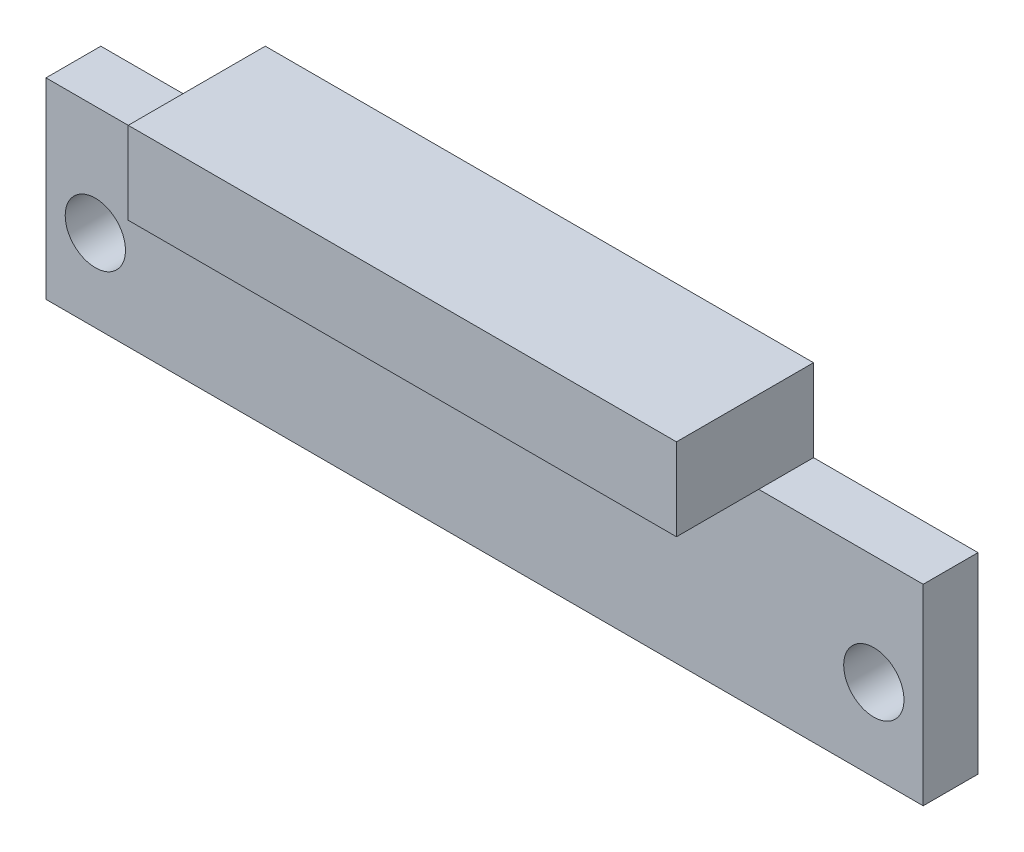
ISO-10303-21;
HEADER;
FILE_DESCRIPTION(('STEP AP214'),'2;1');
FILE_NAME('part.step','',(''),(''),'','','');
FILE_SCHEMA(('AUTOMOTIVE_DESIGN { 1 0 10303 214 1 1 1 1 }'));
ENDSEC;
DATA;
#1=APPLICATION_CONTEXT('core data for automotive mechanical design processes');
#2=APPLICATION_PROTOCOL_DEFINITION('international standard','automotive_design',2000,#1);
#3=PRODUCT_CONTEXT('',#1,'mechanical');
#4=PRODUCT('Part','Part','',(#3));
#5=PRODUCT_RELATED_PRODUCT_CATEGORY('part','',(#4));
#6=PRODUCT_DEFINITION_FORMATION('','',#4);
#7=PRODUCT_DEFINITION_CONTEXT('part definition',#1,'design');
#8=PRODUCT_DEFINITION('design','',#6,#7);
#9=PRODUCT_DEFINITION_SHAPE('','',#8);
#10=(LENGTH_UNIT() NAMED_UNIT(*) SI_UNIT(.MILLI.,.METRE.));
#11=(NAMED_UNIT(*) PLANE_ANGLE_UNIT() SI_UNIT($,.RADIAN.));
#12=(NAMED_UNIT(*) SI_UNIT($,.STERADIAN.) SOLID_ANGLE_UNIT());
#13=UNCERTAINTY_MEASURE_WITH_UNIT(LENGTH_MEASURE(1.E-05),#10,'distance_accuracy_value','');
#14=(GEOMETRIC_REPRESENTATION_CONTEXT(3) GLOBAL_UNCERTAINTY_ASSIGNED_CONTEXT((#13)) GLOBAL_UNIT_ASSIGNED_CONTEXT((#10,
#11,#12)) REPRESENTATION_CONTEXT('',''));
#15=CARTESIAN_POINT('',(0.,0.,0.));
#16=DIRECTION('',(0.,0.,1.));
#17=DIRECTION('',(1.,0.,0.));
#18=AXIS2_PLACEMENT_3D('',#15,#16,#17);
#19=CARTESIAN_POINT('',(0.,7.,2.));
#20=DIRECTION('',(0.,-1.,0.));
#21=DIRECTION('',(0.,0.,-1.));
#22=AXIS2_PLACEMENT_3D('',#19,#20,#21);
#23=PLANE('',#22);
#24=DIRECTION('',(0.,0.,-1.));
#25=VECTOR('',#24,1.);
#26=CARTESIAN_POINT('',(26.,7.,5.));
#27=LINE('',#26,#25);
#28=CARTESIAN_POINT('',(26.,7.,2.));
#29=VERTEX_POINT('',#28);
#30=CARTESIAN_POINT('',(26.,7.,0.));
#31=VERTEX_POINT('',#30);
#32=EDGE_CURVE('E11',#29,#31,#27,.T.);
#33=ORIENTED_EDGE('',*,*,#32,.F.);
#34=DIRECTION('',(-1.,0.,0.));
#35=VECTOR('',#34,1.);
#36=CARTESIAN_POINT('',(0.,7.,2.));
#37=LINE('',#36,#35);
#38=CARTESIAN_POINT('',(32.,7.,2.));
#39=VERTEX_POINT('',#38);
#40=EDGE_CURVE('E173',#39,#29,#37,.T.);
#41=ORIENTED_EDGE('',*,*,#40,.F.);
#42=DIRECTION('',(0.,0.,-1.));
#43=VECTOR('',#42,1.);
#44=CARTESIAN_POINT('',(32.,7.,2.));
#45=LINE('',#44,#43);
#46=CARTESIAN_POINT('',(32.,7.,0.));
#47=VERTEX_POINT('',#46);
#48=EDGE_CURVE('E186',#39,#47,#45,.T.);
#49=ORIENTED_EDGE('',*,*,#48,.T.);
#50=DIRECTION('',(-1.,0.,0.));
#51=VECTOR('',#50,1.);
#52=CARTESIAN_POINT('',(0.,7.,0.));
#53=LINE('',#52,#51);
#54=EDGE_CURVE('E169',#47,#31,#53,.T.);
#55=ORIENTED_EDGE('',*,*,#54,.T.);
#56=EDGE_LOOP('',(#33,#41,#49,#55));
#57=FACE_BOUND('',#56,.T.);
#58=ADVANCED_FACE('F33',(#57),#23,.F.);
#59=CARTESIAN_POINT('',(0.,0.,2.));
#60=DIRECTION('',(1.,0.,0.));
#61=DIRECTION('',(0.,0.,-1.));
#62=AXIS2_PLACEMENT_3D('',#59,#60,#61);
#63=PLANE('',#62);
#64=DIRECTION('',(0.,-1.,0.));
#65=VECTOR('',#64,1.);
#66=CARTESIAN_POINT('',(0.,0.,0.));
#67=LINE('',#66,#65);
#68=CARTESIAN_POINT('',(0.,7.,0.));
#69=VERTEX_POINT('',#68);
#70=CARTESIAN_POINT('',(0.,0.,0.));
#71=VERTEX_POINT('',#70);
#72=EDGE_CURVE('E158',#69,#71,#67,.T.);
#73=ORIENTED_EDGE('',*,*,#72,.T.);
#74=DIRECTION('',(0.,0.,-1.));
#75=VECTOR('',#74,1.);
#76=CARTESIAN_POINT('',(0.,0.,2.));
#77=LINE('',#76,#75);
#78=CARTESIAN_POINT('',(0.,0.,2.));
#79=VERTEX_POINT('',#78);
#80=EDGE_CURVE('E37',#79,#71,#77,.T.);
#81=ORIENTED_EDGE('',*,*,#80,.F.);
#82=DIRECTION('',(0.,-1.,0.));
#83=VECTOR('',#82,1.);
#84=CARTESIAN_POINT('',(0.,0.,2.));
#85=LINE('',#84,#83);
#86=CARTESIAN_POINT('',(0.,7.,2.));
#87=VERTEX_POINT('',#86);
#88=EDGE_CURVE('E167',#87,#79,#85,.T.);
#89=ORIENTED_EDGE('',*,*,#88,.F.);
#90=DIRECTION('',(0.,0.,-1.));
#91=VECTOR('',#90,1.);
#92=CARTESIAN_POINT('',(0.,7.,2.));
#93=LINE('',#92,#91);
#94=EDGE_CURVE('E176',#87,#69,#93,.T.);
#95=ORIENTED_EDGE('',*,*,#94,.T.);
#96=EDGE_LOOP('',(#73,#81,#89,#95));
#97=FACE_BOUND('',#96,.T.);
#98=ADVANCED_FACE('F35',(#97),#63,.F.);
#99=CARTESIAN_POINT('',(0.,0.,2.));
#100=DIRECTION('',(0.,1.,0.));
#101=DIRECTION('',(0.,0.,1.));
#102=AXIS2_PLACEMENT_3D('',#99,#100,#101);
#103=PLANE('',#102);
#104=DIRECTION('',(1.,0.,0.));
#105=VECTOR('',#104,1.);
#106=CARTESIAN_POINT('',(0.,0.,0.));
#107=LINE('',#106,#105);
#108=CARTESIAN_POINT('',(32.,0.,0.));
#109=VERTEX_POINT('',#108);
#110=EDGE_CURVE('E179',#71,#109,#107,.T.);
#111=ORIENTED_EDGE('',*,*,#110,.T.);
#112=DIRECTION('',(0.,0.,-1.));
#113=VECTOR('',#112,1.);
#114=CARTESIAN_POINT('',(32.,0.,2.));
#115=LINE('',#114,#113);
#116=CARTESIAN_POINT('',(32.,0.,2.));
#117=VERTEX_POINT('',#116);
#118=EDGE_CURVE('E188',#117,#109,#115,.T.);
#119=ORIENTED_EDGE('',*,*,#118,.F.);
#120=DIRECTION('',(1.,0.,0.));
#121=VECTOR('',#120,1.);
#122=CARTESIAN_POINT('',(0.,0.,2.));
#123=LINE('',#122,#121);
#124=EDGE_CURVE('E89',#79,#117,#123,.T.);
#125=ORIENTED_EDGE('',*,*,#124,.F.);
#126=ORIENTED_EDGE('',*,*,#80,.T.);
#127=EDGE_LOOP('',(#111,#119,#125,#126));
#128=FACE_BOUND('',#127,.T.);
#129=ADVANCED_FACE('F203',(#128),#103,.F.);
#130=CARTESIAN_POINT('',(32.,0.,2.));
#131=DIRECTION('',(-1.,0.,0.));
#132=DIRECTION('',(0.,0.,1.));
#133=AXIS2_PLACEMENT_3D('',#130,#131,#132);
#134=PLANE('',#133);
#135=DIRECTION('',(0.,1.,0.));
#136=VECTOR('',#135,1.);
#137=CARTESIAN_POINT('',(32.,0.,0.));
#138=LINE('',#137,#136);
#139=EDGE_CURVE('E181',#109,#47,#138,.T.);
#140=ORIENTED_EDGE('',*,*,#139,.T.);
#141=ORIENTED_EDGE('',*,*,#48,.F.);
#142=DIRECTION('',(0.,1.,0.));
#143=VECTOR('',#142,1.);
#144=CARTESIAN_POINT('',(32.,0.,2.));
#145=LINE('',#144,#143);
#146=EDGE_CURVE('E171',#117,#39,#145,.T.);
#147=ORIENTED_EDGE('',*,*,#146,.F.);
#148=ORIENTED_EDGE('',*,*,#118,.T.);
#149=EDGE_LOOP('',(#140,#141,#147,#148));
#150=FACE_BOUND('',#149,.T.);
#151=ADVANCED_FACE('F204',(#150),#134,.F.);
#152=CARTESIAN_POINT('',(6.,7.,2.));
#153=VERTEX_POINT('',#152);
#154=EDGE_CURVE('E60',#153,#87,#37,.T.);
#155=ORIENTED_EDGE('',*,*,#154,.F.);
#156=DIRECTION('',(0.,0.,-1.));
#157=VECTOR('',#156,1.);
#158=CARTESIAN_POINT('',(6.,7.,5.));
#159=LINE('',#158,#157);
#160=CARTESIAN_POINT('',(6.,7.,0.));
#161=VERTEX_POINT('',#160);
#162=EDGE_CURVE('E42',#153,#161,#159,.T.);
#163=ORIENTED_EDGE('',*,*,#162,.T.);
#164=EDGE_CURVE('E81',#161,#69,#53,.T.);
#165=ORIENTED_EDGE('',*,*,#164,.T.);
#166=ORIENTED_EDGE('',*,*,#94,.F.);
#167=EDGE_LOOP('',(#155,#163,#165,#166));
#168=FACE_BOUND('',#167,.T.);
#169=ADVANCED_FACE('F194',(#168),#23,.F.);
#170=CARTESIAN_POINT('',(0.,0.,2.));
#171=DIRECTION('',(0.,0.,-1.));
#172=DIRECTION('',(-1.,0.,0.));
#173=AXIS2_PLACEMENT_3D('',#170,#171,#172);
#174=PLANE('',#173);
#175=CARTESIAN_POINT('',(30.2,3.,2.));
#176=DIRECTION('',(0.,0.,-1.));
#177=DIRECTION('',(-1.,0.,0.));
#178=AXIS2_PLACEMENT_3D('',#175,#176,#177);
#179=CIRCLE('',#178,1.1);
#180=CARTESIAN_POINT('',(29.1,3.,2.));
#181=VERTEX_POINT('',#180);
#182=EDGE_CURVE('E155',#181,#181,#179,.T.);
#183=ORIENTED_EDGE('',*,*,#182,.T.);
#184=EDGE_LOOP('',(#183));
#185=FACE_BOUND('',#184,.T.);
#186=CARTESIAN_POINT('',(1.8,3.,2.));
#187=DIRECTION('',(0.,0.,-1.));
#188=DIRECTION('',(-1.,0.,0.));
#189=AXIS2_PLACEMENT_3D('',#186,#187,#188);
#190=CIRCLE('',#189,1.1);
#191=CARTESIAN_POINT('',(0.700000000000003,3.,2.));
#192=VERTEX_POINT('',#191);
#193=EDGE_CURVE('E162',#192,#192,#190,.T.);
#194=ORIENTED_EDGE('',*,*,#193,.T.);
#195=EDGE_LOOP('',(#194));
#196=FACE_BOUND('',#195,.T.);
#197=ORIENTED_EDGE('',*,*,#88,.T.);
#198=ORIENTED_EDGE('',*,*,#124,.T.);
#199=ORIENTED_EDGE('',*,*,#146,.T.);
#200=ORIENTED_EDGE('',*,*,#40,.T.);
#201=EDGE_CURVE('E120',#29,#153,#37,.T.);
#202=ORIENTED_EDGE('',*,*,#201,.T.);
#203=ORIENTED_EDGE('',*,*,#154,.T.);
#204=EDGE_LOOP('',(#197,#198,#199,#200,#202,#203));
#205=FACE_BOUND('',#204,.T.);
#206=ADVANCED_FACE('F201',(#185,#196,#205),#174,.F.);
#207=CARTESIAN_POINT('',(0.,0.,0.));
#208=DIRECTION('',(0.,0.,-1.));
#209=DIRECTION('',(-1.,0.,0.));
#210=AXIS2_PLACEMENT_3D('',#207,#208,#209);
#211=PLANE('',#210);
#212=CARTESIAN_POINT('',(30.2,3.,0.));
#213=DIRECTION('',(0.,0.,-1.));
#214=DIRECTION('',(-1.,0.,0.));
#215=AXIS2_PLACEMENT_3D('',#212,#213,#214);
#216=CIRCLE('',#215,1.1);
#217=CARTESIAN_POINT('',(29.1,3.,0.));
#218=VERTEX_POINT('',#217);
#219=EDGE_CURVE('E159',#218,#218,#216,.T.);
#220=ORIENTED_EDGE('',*,*,#219,.F.);
#221=EDGE_LOOP('',(#220));
#222=FACE_BOUND('',#221,.T.);
#223=CARTESIAN_POINT('',(1.8,3.,0.));
#224=DIRECTION('',(0.,0.,-1.));
#225=DIRECTION('',(-1.,0.,0.));
#226=AXIS2_PLACEMENT_3D('',#223,#224,#225);
#227=CIRCLE('',#226,1.1);
#228=CARTESIAN_POINT('',(0.700000000000003,3.,0.));
#229=VERTEX_POINT('',#228);
#230=EDGE_CURVE('E151',#229,#229,#227,.T.);
#231=ORIENTED_EDGE('',*,*,#230,.F.);
#232=EDGE_LOOP('',(#231));
#233=FACE_BOUND('',#232,.T.);
#234=ORIENTED_EDGE('',*,*,#72,.F.);
#235=ORIENTED_EDGE('',*,*,#164,.F.);
#236=DIRECTION('',(0.,1.,0.));
#237=VECTOR('',#236,1.);
#238=CARTESIAN_POINT('',(6.,7.,0.));
#239=LINE('',#238,#237);
#240=CARTESIAN_POINT('',(6.,10.,0.));
#241=VERTEX_POINT('',#240);
#242=EDGE_CURVE('E51',#161,#241,#239,.T.);
#243=ORIENTED_EDGE('',*,*,#242,.T.);
#244=DIRECTION('',(1.,0.,0.));
#245=VECTOR('',#244,1.);
#246=CARTESIAN_POINT('',(26.,10.,0.));
#247=LINE('',#246,#245);
#248=CARTESIAN_POINT('',(26.,10.,0.));
#249=VERTEX_POINT('',#248);
#250=EDGE_CURVE('E139',#241,#249,#247,.T.);
#251=ORIENTED_EDGE('',*,*,#250,.T.);
#252=DIRECTION('',(0.,-1.,0.));
#253=VECTOR('',#252,1.);
#254=CARTESIAN_POINT('',(26.,7.,0.));
#255=LINE('',#254,#253);
#256=EDGE_CURVE('E146',#249,#31,#255,.T.);
#257=ORIENTED_EDGE('',*,*,#256,.T.);
#258=ORIENTED_EDGE('',*,*,#54,.F.);
#259=ORIENTED_EDGE('',*,*,#139,.F.);
#260=ORIENTED_EDGE('',*,*,#110,.F.);
#261=EDGE_LOOP('',(#234,#235,#243,#251,#257,#258,#259,#260));
#262=FACE_BOUND('',#261,.T.);
#263=ADVANCED_FACE('F197',(#222,#233,#262),#211,.T.);
#264=CARTESIAN_POINT('',(1.8,3.,2.));
#265=DIRECTION('',(0.,0.,-1.));
#266=DIRECTION('',(-1.,0.,0.));
#267=AXIS2_PLACEMENT_3D('',#264,#265,#266);
#268=CYLINDRICAL_SURFACE('',#267,1.1);
#269=ORIENTED_EDGE('',*,*,#193,.F.);
#270=EDGE_LOOP('',(#269));
#271=FACE_BOUND('',#270,.T.);
#272=ORIENTED_EDGE('',*,*,#230,.T.);
#273=EDGE_LOOP('',(#272));
#274=FACE_BOUND('',#273,.T.);
#275=ADVANCED_FACE('F270',(#271,#274),#268,.F.);
#276=CARTESIAN_POINT('',(30.2,3.,2.));
#277=DIRECTION('',(0.,0.,-1.));
#278=DIRECTION('',(-1.,0.,0.));
#279=AXIS2_PLACEMENT_3D('',#276,#277,#278);
#280=CYLINDRICAL_SURFACE('',#279,1.1);
#281=ORIENTED_EDGE('',*,*,#182,.F.);
#282=EDGE_LOOP('',(#281));
#283=FACE_BOUND('',#282,.T.);
#284=ORIENTED_EDGE('',*,*,#219,.T.);
#285=EDGE_LOOP('',(#284));
#286=FACE_BOUND('',#285,.T.);
#287=ADVANCED_FACE('F280',(#283,#286),#280,.F.);
#288=CARTESIAN_POINT('',(26.,7.,5.));
#289=DIRECTION('',(0.,-1.,0.));
#290=DIRECTION('',(0.,0.,-1.));
#291=AXIS2_PLACEMENT_3D('',#288,#289,#290);
#292=PLANE('',#291);
#293=ORIENTED_EDGE('',*,*,#201,.F.);
#294=CARTESIAN_POINT('',(26.,7.,5.));
#295=VERTEX_POINT('',#294);
#296=EDGE_CURVE('E44',#295,#29,#27,.T.);
#297=ORIENTED_EDGE('',*,*,#296,.F.);
#298=DIRECTION('',(-1.,0.,0.));
#299=VECTOR('',#298,1.);
#300=CARTESIAN_POINT('',(26.,7.,5.));
#301=LINE('',#300,#299);
#302=CARTESIAN_POINT('',(6.,7.,5.));
#303=VERTEX_POINT('',#302);
#304=EDGE_CURVE('E119',#295,#303,#301,.T.);
#305=ORIENTED_EDGE('',*,*,#304,.T.);
#306=EDGE_CURVE('E124',#303,#153,#159,.T.);
#307=ORIENTED_EDGE('',*,*,#306,.T.);
#308=EDGE_LOOP('',(#293,#297,#305,#307));
#309=FACE_BOUND('',#308,.T.);
#310=ADVANCED_FACE('F117',(#309),#292,.T.);
#311=CARTESIAN_POINT('',(26.,7.,5.));
#312=DIRECTION('',(1.,0.,0.));
#313=DIRECTION('',(0.,0.,-1.));
#314=AXIS2_PLACEMENT_3D('',#311,#312,#313);
#315=PLANE('',#314);
#316=ORIENTED_EDGE('',*,*,#256,.F.);
#317=DIRECTION('',(0.,0.,-1.));
#318=VECTOR('',#317,1.);
#319=CARTESIAN_POINT('',(26.,10.,5.));
#320=LINE('',#319,#318);
#321=CARTESIAN_POINT('',(26.,10.,5.));
#322=VERTEX_POINT('',#321);
#323=EDGE_CURVE('E138',#322,#249,#320,.T.);
#324=ORIENTED_EDGE('',*,*,#323,.F.);
#325=DIRECTION('',(0.,-1.,0.));
#326=VECTOR('',#325,1.);
#327=CARTESIAN_POINT('',(26.,7.,5.));
#328=LINE('',#327,#326);
#329=EDGE_CURVE('E131',#322,#295,#328,.T.);
#330=ORIENTED_EDGE('',*,*,#329,.T.);
#331=ORIENTED_EDGE('',*,*,#296,.T.);
#332=ORIENTED_EDGE('',*,*,#32,.T.);
#333=EDGE_LOOP('',(#316,#324,#330,#331,#332));
#334=FACE_BOUND('',#333,.T.);
#335=ADVANCED_FACE('F137',(#334),#315,.T.);
#336=CARTESIAN_POINT('',(26.,10.,5.));
#337=DIRECTION('',(0.,1.,0.));
#338=DIRECTION('',(0.,0.,1.));
#339=AXIS2_PLACEMENT_3D('',#336,#337,#338);
#340=PLANE('',#339);
#341=ORIENTED_EDGE('',*,*,#250,.F.);
#342=DIRECTION('',(0.,0.,-1.));
#343=VECTOR('',#342,1.);
#344=CARTESIAN_POINT('',(6.,10.,5.));
#345=LINE('',#344,#343);
#346=CARTESIAN_POINT('',(6.,10.,5.));
#347=VERTEX_POINT('',#346);
#348=EDGE_CURVE('E152',#347,#241,#345,.T.);
#349=ORIENTED_EDGE('',*,*,#348,.F.);
#350=DIRECTION('',(1.,0.,0.));
#351=VECTOR('',#350,1.);
#352=CARTESIAN_POINT('',(26.,10.,5.));
#353=LINE('',#352,#351);
#354=EDGE_CURVE('E125',#347,#322,#353,.T.);
#355=ORIENTED_EDGE('',*,*,#354,.T.);
#356=ORIENTED_EDGE('',*,*,#323,.T.);
#357=EDGE_LOOP('',(#341,#349,#355,#356));
#358=FACE_BOUND('',#357,.T.);
#359=ADVANCED_FACE('F209',(#358),#340,.T.);
#360=CARTESIAN_POINT('',(6.,7.,5.));
#361=DIRECTION('',(-1.,0.,0.));
#362=DIRECTION('',(0.,0.,1.));
#363=AXIS2_PLACEMENT_3D('',#360,#361,#362);
#364=PLANE('',#363);
#365=ORIENTED_EDGE('',*,*,#242,.F.);
#366=ORIENTED_EDGE('',*,*,#162,.F.);
#367=ORIENTED_EDGE('',*,*,#306,.F.);
#368=DIRECTION('',(0.,1.,0.));
#369=VECTOR('',#368,1.);
#370=CARTESIAN_POINT('',(6.,7.,5.));
#371=LINE('',#370,#369);
#372=EDGE_CURVE('E134',#303,#347,#371,.T.);
#373=ORIENTED_EDGE('',*,*,#372,.T.);
#374=ORIENTED_EDGE('',*,*,#348,.T.);
#375=EDGE_LOOP('',(#365,#366,#367,#373,#374));
#376=FACE_BOUND('',#375,.T.);
#377=ADVANCED_FACE('F210',(#376),#364,.T.);
#378=CARTESIAN_POINT('',(0.,0.,5.));
#379=DIRECTION('',(0.,0.,1.));
#380=DIRECTION('',(1.,0.,0.));
#381=AXIS2_PLACEMENT_3D('',#378,#379,#380);
#382=PLANE('',#381);
#383=ORIENTED_EDGE('',*,*,#329,.F.);
#384=ORIENTED_EDGE('',*,*,#354,.F.);
#385=ORIENTED_EDGE('',*,*,#372,.F.);
#386=ORIENTED_EDGE('',*,*,#304,.F.);
#387=EDGE_LOOP('',(#383,#384,#385,#386));
#388=FACE_BOUND('',#387,.T.);
#389=ADVANCED_FACE('F129',(#388),#382,.T.);
#390=CLOSED_SHELL('',(#58,#98,#129,#151,#169,#206,#263,#275,#287,#310,#335,#359,#377,#389));
#391=MANIFOLD_SOLID_BREP('B2',#390);
#392=ADVANCED_BREP_SHAPE_REPRESENTATION('',(#18,#391),#14);
#393=SHAPE_DEFINITION_REPRESENTATION(#9,#392);
ENDSEC;
END-ISO-10303-21;
